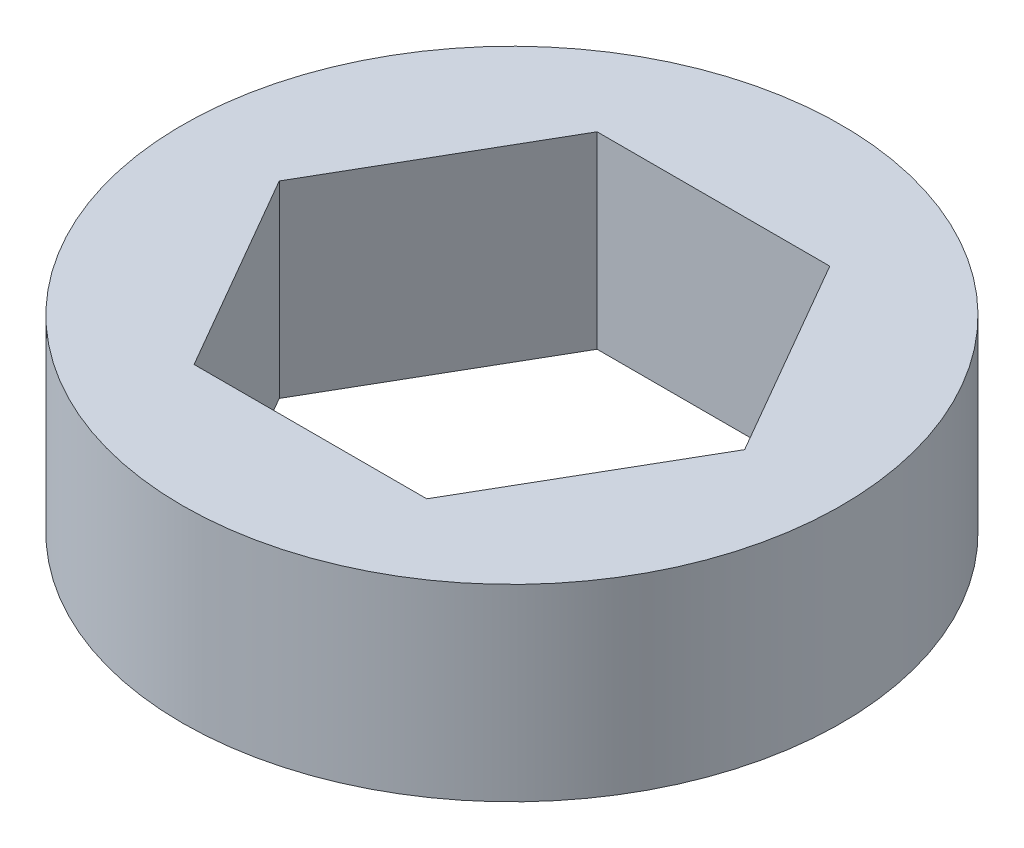
ISO-10303-21;
HEADER;
FILE_DESCRIPTION(('STEP AP214'),'2;1');
FILE_NAME('part.step','',(''),(''),'','','');
FILE_SCHEMA(('AUTOMOTIVE_DESIGN { 1 0 10303 214 1 1 1 1 }'));
ENDSEC;
DATA;
#1=APPLICATION_CONTEXT('core data for automotive mechanical design processes');
#2=APPLICATION_PROTOCOL_DEFINITION('international standard','automotive_design',2000,#1);
#3=PRODUCT_CONTEXT('',#1,'mechanical');
#4=PRODUCT('Part','Part','',(#3));
#5=PRODUCT_RELATED_PRODUCT_CATEGORY('part','',(#4));
#6=PRODUCT_DEFINITION_FORMATION('','',#4);
#7=PRODUCT_DEFINITION_CONTEXT('part definition',#1,'design');
#8=PRODUCT_DEFINITION('design','',#6,#7);
#9=PRODUCT_DEFINITION_SHAPE('','',#8);
#10=(LENGTH_UNIT() NAMED_UNIT(*) SI_UNIT(.MILLI.,.METRE.));
#11=(NAMED_UNIT(*) PLANE_ANGLE_UNIT() SI_UNIT($,.RADIAN.));
#12=(NAMED_UNIT(*) SI_UNIT($,.STERADIAN.) SOLID_ANGLE_UNIT());
#13=UNCERTAINTY_MEASURE_WITH_UNIT(LENGTH_MEASURE(1.E-05),#10,'distance_accuracy_value','');
#14=(GEOMETRIC_REPRESENTATION_CONTEXT(3) GLOBAL_UNCERTAINTY_ASSIGNED_CONTEXT((#13)) GLOBAL_UNIT_ASSIGNED_CONTEXT((#10,
#11,#12)) REPRESENTATION_CONTEXT('',''));
#15=CARTESIAN_POINT('',(0.,0.,0.));
#16=DIRECTION('',(0.,0.,1.));
#17=DIRECTION('',(1.,0.,0.));
#18=AXIS2_PLACEMENT_3D('',#15,#16,#17);
#19=CARTESIAN_POINT('',(0.,6.35,0.));
#20=DIRECTION('',(0.,1.,0.));
#21=DIRECTION('',(0.,0.,1.));
#22=AXIS2_PLACEMENT_3D('',#19,#20,#21);
#23=PLANE('',#22);
#24=CARTESIAN_POINT('',(0.,6.35,0.));
#25=DIRECTION('',(0.,1.,0.));
#26=DIRECTION('',(0.,0.,1.));
#27=AXIS2_PLACEMENT_3D('',#24,#25,#26);
#28=CIRCLE('',#27,11.1125);
#29=CARTESIAN_POINT('',(0.,6.35,11.1125));
#30=VERTEX_POINT('',#29);
#31=EDGE_CURVE('E11',#30,#30,#28,.T.);
#32=ORIENTED_EDGE('',*,*,#31,.T.);
#33=EDGE_LOOP('',(#32));
#34=FACE_BOUND('',#33,.T.);
#35=DIRECTION('',(-0.5,0.,-0.866025403784439));
#36=VECTOR('',#35,1.);
#37=CARTESIAN_POINT('',(7.84561280801783,6.35,0.));
#38=LINE('',#37,#36);
#39=CARTESIAN_POINT('',(7.84561280801783,6.35,0.));
#40=VERTEX_POINT('',#39);
#41=CARTESIAN_POINT('',(3.9228064040089,6.35,-6.79450000000002));
#42=VERTEX_POINT('',#41);
#43=EDGE_CURVE('E93',#40,#42,#38,.T.);
#44=ORIENTED_EDGE('',*,*,#43,.F.);
#45=DIRECTION('',(0.5,0.,-0.866025403784439));
#46=VECTOR('',#45,1.);
#47=CARTESIAN_POINT('',(3.92280640400891,6.35,6.79450000000001));
#48=LINE('',#47,#46);
#49=CARTESIAN_POINT('',(3.92280640400891,6.35,6.79450000000001));
#50=VERTEX_POINT('',#49);
#51=EDGE_CURVE('E85',#50,#40,#48,.T.);
#52=ORIENTED_EDGE('',*,*,#51,.F.);
#53=DIRECTION('',(1.,0.,0.));
#54=VECTOR('',#53,1.);
#55=CARTESIAN_POINT('',(-3.92280640400892,6.35,6.79450000000001));
#56=LINE('',#55,#54);
#57=CARTESIAN_POINT('',(-3.92280640400892,6.35,6.79450000000001));
#58=VERTEX_POINT('',#57);
#59=EDGE_CURVE('E113',#58,#50,#56,.T.);
#60=ORIENTED_EDGE('',*,*,#59,.F.);
#61=DIRECTION('',(0.5,0.,0.866025403784439));
#62=VECTOR('',#61,1.);
#63=CARTESIAN_POINT('',(-7.84561280801784,6.35,0.));
#64=LINE('',#63,#62);
#65=CARTESIAN_POINT('',(-7.84561280801784,6.35,0.));
#66=VERTEX_POINT('',#65);
#67=EDGE_CURVE('E111',#66,#58,#64,.T.);
#68=ORIENTED_EDGE('',*,*,#67,.F.);
#69=DIRECTION('',(-0.5,0.,0.866025403784439));
#70=VECTOR('',#69,1.);
#71=CARTESIAN_POINT('',(-3.92280640400892,6.35,-6.79450000000002));
#72=LINE('',#71,#70);
#73=CARTESIAN_POINT('',(-3.92280640400892,6.35,-6.79450000000002));
#74=VERTEX_POINT('',#73);
#75=EDGE_CURVE('E107',#74,#66,#72,.T.);
#76=ORIENTED_EDGE('',*,*,#75,.F.);
#77=DIRECTION('',(-1.,0.,0.));
#78=VECTOR('',#77,1.);
#79=CARTESIAN_POINT('',(3.9228064040089,6.35,-6.79450000000002));
#80=LINE('',#79,#78);
#81=EDGE_CURVE('E105',#42,#74,#80,.T.);
#82=ORIENTED_EDGE('',*,*,#81,.F.);
#83=EDGE_LOOP('',(#44,#52,#60,#68,#76,#82));
#84=FACE_BOUND('',#83,.T.);
#85=ADVANCED_FACE('F32',(#34,#84),#23,.T.);
#86=CARTESIAN_POINT('',(0.,0.,0.));
#87=DIRECTION('',(0.,1.,0.));
#88=DIRECTION('',(0.,0.,1.));
#89=AXIS2_PLACEMENT_3D('',#86,#87,#88);
#90=PLANE('',#89);
#91=CARTESIAN_POINT('',(0.,0.,0.));
#92=DIRECTION('',(0.,1.,0.));
#93=DIRECTION('',(0.,0.,1.));
#94=AXIS2_PLACEMENT_3D('',#91,#92,#93);
#95=CIRCLE('',#94,11.1125);
#96=CARTESIAN_POINT('',(0.,0.,11.1125));
#97=VERTEX_POINT('',#96);
#98=EDGE_CURVE('E36',#97,#97,#95,.T.);
#99=ORIENTED_EDGE('',*,*,#98,.F.);
#100=EDGE_LOOP('',(#99));
#101=FACE_BOUND('',#100,.T.);
#102=DIRECTION('',(0.5,0.,-0.866025403784439));
#103=VECTOR('',#102,1.);
#104=CARTESIAN_POINT('',(3.92280640400891,0.,6.79450000000001));
#105=LINE('',#104,#103);
#106=CARTESIAN_POINT('',(3.92280640400891,0.,6.79450000000001));
#107=VERTEX_POINT('',#106);
#108=CARTESIAN_POINT('',(7.84561280801783,0.,0.));
#109=VERTEX_POINT('',#108);
#110=EDGE_CURVE('E55',#107,#109,#105,.T.);
#111=ORIENTED_EDGE('',*,*,#110,.T.);
#112=DIRECTION('',(-0.5,0.,-0.866025403784439));
#113=VECTOR('',#112,1.);
#114=CARTESIAN_POINT('',(7.84561280801783,0.,0.));
#115=LINE('',#114,#113);
#116=CARTESIAN_POINT('',(3.9228064040089,0.,-6.79450000000002));
#117=VERTEX_POINT('',#116);
#118=EDGE_CURVE('E100',#109,#117,#115,.T.);
#119=ORIENTED_EDGE('',*,*,#118,.T.);
#120=DIRECTION('',(-1.,0.,0.));
#121=VECTOR('',#120,1.);
#122=CARTESIAN_POINT('',(3.9228064040089,0.,-6.79450000000002));
#123=LINE('',#122,#121);
#124=CARTESIAN_POINT('',(-3.92280640400892,0.,-6.79450000000002));
#125=VERTEX_POINT('',#124);
#126=EDGE_CURVE('E117',#117,#125,#123,.T.);
#127=ORIENTED_EDGE('',*,*,#126,.T.);
#128=DIRECTION('',(-0.5,0.,0.866025403784439));
#129=VECTOR('',#128,1.);
#130=CARTESIAN_POINT('',(-3.92280640400892,0.,-6.79450000000002));
#131=LINE('',#130,#129);
#132=CARTESIAN_POINT('',(-7.84561280801784,0.,0.));
#133=VERTEX_POINT('',#132);
#134=EDGE_CURVE('E120',#125,#133,#131,.T.);
#135=ORIENTED_EDGE('',*,*,#134,.T.);
#136=DIRECTION('',(0.5,0.,0.866025403784439));
#137=VECTOR('',#136,1.);
#138=CARTESIAN_POINT('',(-7.84561280801784,0.,0.));
#139=LINE('',#138,#137);
#140=CARTESIAN_POINT('',(-3.92280640400892,0.,6.79450000000001));
#141=VERTEX_POINT('',#140);
#142=EDGE_CURVE('E123',#133,#141,#139,.T.);
#143=ORIENTED_EDGE('',*,*,#142,.T.);
#144=DIRECTION('',(1.,0.,0.));
#145=VECTOR('',#144,1.);
#146=CARTESIAN_POINT('',(-3.92280640400892,0.,6.79450000000001));
#147=LINE('',#146,#145);
#148=EDGE_CURVE('E94',#141,#107,#147,.T.);
#149=ORIENTED_EDGE('',*,*,#148,.T.);
#150=EDGE_LOOP('',(#111,#119,#127,#135,#143,#149));
#151=FACE_BOUND('',#150,.T.);
#152=ADVANCED_FACE('F140',(#101,#151),#90,.F.);
#153=CARTESIAN_POINT('',(0.,6.35,0.));
#154=DIRECTION('',(0.,-1.,0.));
#155=DIRECTION('',(0.,0.,-1.));
#156=AXIS2_PLACEMENT_3D('',#153,#154,#155);
#157=CYLINDRICAL_SURFACE('',#156,11.1125);
#158=ORIENTED_EDGE('',*,*,#31,.F.);
#159=EDGE_LOOP('',(#158));
#160=FACE_BOUND('',#159,.T.);
#161=ORIENTED_EDGE('',*,*,#98,.T.);
#162=EDGE_LOOP('',(#161));
#163=FACE_BOUND('',#162,.T.);
#164=ADVANCED_FACE('F34',(#160,#163),#157,.T.);
#165=CARTESIAN_POINT('',(3.92280640400891,6.35,6.79450000000001));
#166=DIRECTION('',(-0.866025403784439,0.,-0.5));
#167=DIRECTION('',(-0.5,0.,0.866025403784439));
#168=AXIS2_PLACEMENT_3D('',#165,#166,#167);
#169=PLANE('',#168);
#170=ORIENTED_EDGE('',*,*,#110,.F.);
#171=DIRECTION('',(0.,-1.,0.));
#172=VECTOR('',#171,1.);
#173=CARTESIAN_POINT('',(3.92280640400891,6.35,6.79450000000001));
#174=LINE('',#173,#172);
#175=EDGE_CURVE('E89',#50,#107,#174,.T.);
#176=ORIENTED_EDGE('',*,*,#175,.F.);
#177=ORIENTED_EDGE('',*,*,#51,.T.);
#178=DIRECTION('',(0.,-1.,0.));
#179=VECTOR('',#178,1.);
#180=CARTESIAN_POINT('',(7.84561280801783,6.35,0.));
#181=LINE('',#180,#179);
#182=EDGE_CURVE('E88',#40,#109,#181,.T.);
#183=ORIENTED_EDGE('',*,*,#182,.T.);
#184=EDGE_LOOP('',(#170,#176,#177,#183));
#185=FACE_BOUND('',#184,.T.);
#186=ADVANCED_FACE('F87',(#185),#169,.T.);
#187=CARTESIAN_POINT('',(7.84561280801783,6.35,0.));
#188=DIRECTION('',(-0.866025403784439,0.,0.5));
#189=DIRECTION('',(0.5,0.,0.866025403784439));
#190=AXIS2_PLACEMENT_3D('',#187,#188,#189);
#191=PLANE('',#190);
#192=ORIENTED_EDGE('',*,*,#118,.F.);
#193=ORIENTED_EDGE('',*,*,#182,.F.);
#194=ORIENTED_EDGE('',*,*,#43,.T.);
#195=DIRECTION('',(0.,-1.,0.));
#196=VECTOR('',#195,1.);
#197=CARTESIAN_POINT('',(3.9228064040089,6.35,-6.79450000000002));
#198=LINE('',#197,#196);
#199=EDGE_CURVE('E101',#42,#117,#198,.T.);
#200=ORIENTED_EDGE('',*,*,#199,.T.);
#201=EDGE_LOOP('',(#192,#193,#194,#200));
#202=FACE_BOUND('',#201,.T.);
#203=ADVANCED_FACE('F97',(#202),#191,.T.);
#204=CARTESIAN_POINT('',(3.9228064040089,6.35,-6.79450000000002));
#205=DIRECTION('',(0.,0.,1.));
#206=DIRECTION('',(1.,0.,0.));
#207=AXIS2_PLACEMENT_3D('',#204,#205,#206);
#208=PLANE('',#207);
#209=ORIENTED_EDGE('',*,*,#126,.F.);
#210=ORIENTED_EDGE('',*,*,#199,.F.);
#211=ORIENTED_EDGE('',*,*,#81,.T.);
#212=DIRECTION('',(0.,-1.,0.));
#213=VECTOR('',#212,1.);
#214=CARTESIAN_POINT('',(-3.92280640400892,6.35,-6.79450000000002));
#215=LINE('',#214,#213);
#216=EDGE_CURVE('E132',#74,#125,#215,.T.);
#217=ORIENTED_EDGE('',*,*,#216,.T.);
#218=EDGE_LOOP('',(#209,#210,#211,#217));
#219=FACE_BOUND('',#218,.T.);
#220=ADVANCED_FACE('F136',(#219),#208,.T.);
#221=CARTESIAN_POINT('',(-3.92280640400892,6.35,-6.79450000000002));
#222=DIRECTION('',(0.866025403784439,0.,0.5));
#223=DIRECTION('',(0.5,0.,-0.866025403784439));
#224=AXIS2_PLACEMENT_3D('',#221,#222,#223);
#225=PLANE('',#224);
#226=ORIENTED_EDGE('',*,*,#134,.F.);
#227=ORIENTED_EDGE('',*,*,#216,.F.);
#228=ORIENTED_EDGE('',*,*,#75,.T.);
#229=DIRECTION('',(0.,-1.,0.));
#230=VECTOR('',#229,1.);
#231=CARTESIAN_POINT('',(-7.84561280801784,6.35,0.));
#232=LINE('',#231,#230);
#233=EDGE_CURVE('E130',#66,#133,#232,.T.);
#234=ORIENTED_EDGE('',*,*,#233,.T.);
#235=EDGE_LOOP('',(#226,#227,#228,#234));
#236=FACE_BOUND('',#235,.T.);
#237=ADVANCED_FACE('F148',(#236),#225,.T.);
#238=CARTESIAN_POINT('',(-7.84561280801784,6.35,0.));
#239=DIRECTION('',(0.866025403784439,0.,-0.5));
#240=DIRECTION('',(-0.5,0.,-0.866025403784439));
#241=AXIS2_PLACEMENT_3D('',#238,#239,#240);
#242=PLANE('',#241);
#243=ORIENTED_EDGE('',*,*,#142,.F.);
#244=ORIENTED_EDGE('',*,*,#233,.F.);
#245=ORIENTED_EDGE('',*,*,#67,.T.);
#246=DIRECTION('',(0.,-1.,0.));
#247=VECTOR('',#246,1.);
#248=CARTESIAN_POINT('',(-3.92280640400892,6.35,6.79450000000001));
#249=LINE('',#248,#247);
#250=EDGE_CURVE('E47',#58,#141,#249,.T.);
#251=ORIENTED_EDGE('',*,*,#250,.T.);
#252=EDGE_LOOP('',(#243,#244,#245,#251));
#253=FACE_BOUND('',#252,.T.);
#254=ADVANCED_FACE('F146',(#253),#242,.T.);
#255=CARTESIAN_POINT('',(-3.92280640400892,6.35,6.79450000000001));
#256=DIRECTION('',(0.,0.,-1.));
#257=DIRECTION('',(-1.,0.,0.));
#258=AXIS2_PLACEMENT_3D('',#255,#256,#257);
#259=PLANE('',#258);
#260=ORIENTED_EDGE('',*,*,#148,.F.);
#261=ORIENTED_EDGE('',*,*,#250,.F.);
#262=ORIENTED_EDGE('',*,*,#59,.T.);
#263=ORIENTED_EDGE('',*,*,#175,.T.);
#264=EDGE_LOOP('',(#260,#261,#262,#263));
#265=FACE_BOUND('',#264,.T.);
#266=ADVANCED_FACE('F142',(#265),#259,.T.);
#267=CLOSED_SHELL('',(#85,#152,#164,#186,#203,#220,#237,#254,#266));
#268=MANIFOLD_SOLID_BREP('B2',#267);
#269=ADVANCED_BREP_SHAPE_REPRESENTATION('',(#18,#268),#14);
#270=SHAPE_DEFINITION_REPRESENTATION(#9,#269);
ENDSEC;
END-ISO-10303-21;
